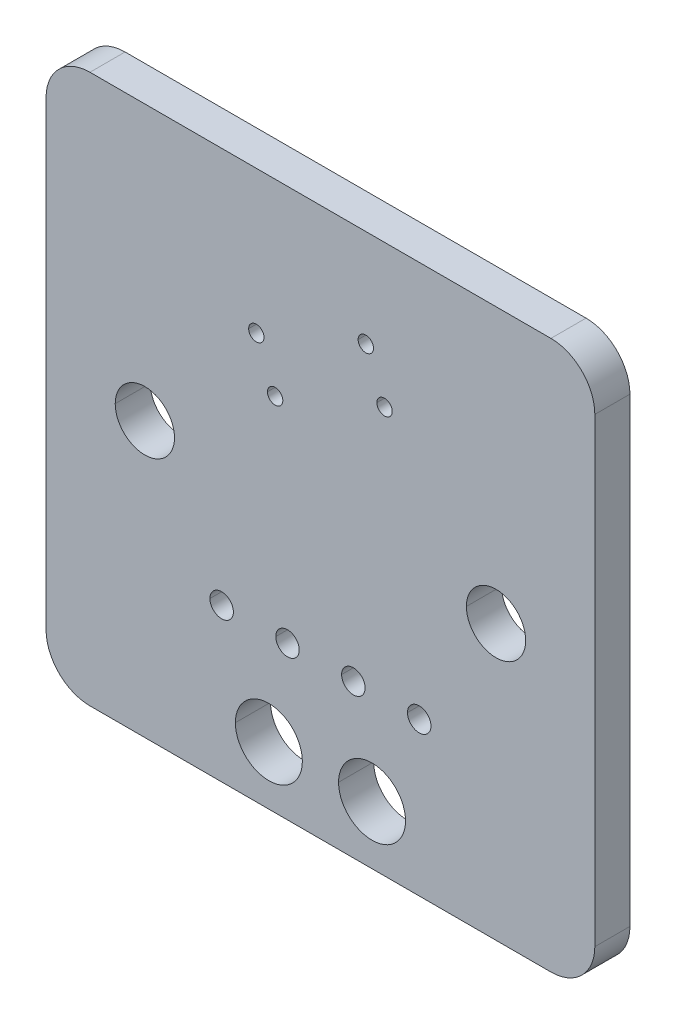
ISO-10303-21;
HEADER;
FILE_DESCRIPTION(('STEP AP214'),'2;1');
FILE_NAME('part.step','',(''),(''),'','','');
FILE_SCHEMA(('AUTOMOTIVE_DESIGN { 1 0 10303 214 1 1 1 1 }'));
ENDSEC;
DATA;
#1=APPLICATION_CONTEXT('core data for automotive mechanical design processes');
#2=APPLICATION_PROTOCOL_DEFINITION('international standard','automotive_design',2000,#1);
#3=PRODUCT_CONTEXT('',#1,'mechanical');
#4=PRODUCT('Part','Part','',(#3));
#5=PRODUCT_RELATED_PRODUCT_CATEGORY('part','',(#4));
#6=PRODUCT_DEFINITION_FORMATION('','',#4);
#7=PRODUCT_DEFINITION_CONTEXT('part definition',#1,'design');
#8=PRODUCT_DEFINITION('design','',#6,#7);
#9=PRODUCT_DEFINITION_SHAPE('','',#8);
#10=(LENGTH_UNIT() NAMED_UNIT(*) SI_UNIT(.MILLI.,.METRE.));
#11=(NAMED_UNIT(*) PLANE_ANGLE_UNIT() SI_UNIT($,.RADIAN.));
#12=(NAMED_UNIT(*) SI_UNIT($,.STERADIAN.) SOLID_ANGLE_UNIT());
#13=UNCERTAINTY_MEASURE_WITH_UNIT(LENGTH_MEASURE(1.E-05),#10,'distance_accuracy_value','');
#14=(GEOMETRIC_REPRESENTATION_CONTEXT(3) GLOBAL_UNCERTAINTY_ASSIGNED_CONTEXT((#13)) GLOBAL_UNIT_ASSIGNED_CONTEXT((#10,
#11,#12)) REPRESENTATION_CONTEXT('',''));
#15=CARTESIAN_POINT('',(0.,0.,0.));
#16=DIRECTION('',(0.,0.,1.));
#17=DIRECTION('',(1.,0.,0.));
#18=AXIS2_PLACEMENT_3D('',#15,#16,#17);
#19=CARTESIAN_POINT('',(43.,-45.,0.));
#20=DIRECTION('',(0.,-1.,0.));
#21=DIRECTION('',(0.,0.,-1.));
#22=AXIS2_PLACEMENT_3D('',#19,#20,#21);
#23=PLANE('',#22);
#24=DIRECTION('',(0.,0.,1.));
#25=VECTOR('',#24,1.);
#26=CARTESIAN_POINT('',(43.,-45.,0.));
#27=LINE('',#26,#25);
#28=CARTESIAN_POINT('',(43.,-45.,0.));
#29=VERTEX_POINT('',#28);
#30=CARTESIAN_POINT('',(43.,-45.,1.6));
#31=VERTEX_POINT('',#30);
#32=EDGE_CURVE('E11',#29,#31,#27,.T.);
#33=ORIENTED_EDGE('',*,*,#32,.T.);
#34=DIRECTION('',(-1.,0.,0.));
#35=VECTOR('',#34,1.);
#36=CARTESIAN_POINT('',(43.,-45.,1.6));
#37=LINE('',#36,#35);
#38=CARTESIAN_POINT('',(22.,-45.,1.6));
#39=VERTEX_POINT('',#38);
#40=EDGE_CURVE('E477',#31,#39,#37,.T.);
#41=ORIENTED_EDGE('',*,*,#40,.T.);
#42=DIRECTION('',(0.,0.,1.));
#43=VECTOR('',#42,1.);
#44=CARTESIAN_POINT('',(22.,-45.,0.));
#45=LINE('',#44,#43);
#46=CARTESIAN_POINT('',(22.,-45.,0.));
#47=VERTEX_POINT('',#46);
#48=EDGE_CURVE('E27',#47,#39,#45,.T.);
#49=ORIENTED_EDGE('',*,*,#48,.F.);
#50=DIRECTION('',(-1.,0.,0.));
#51=VECTOR('',#50,1.);
#52=CARTESIAN_POINT('',(43.,-45.,0.));
#53=LINE('',#52,#51);
#54=EDGE_CURVE('E375',#29,#47,#53,.T.);
#55=ORIENTED_EDGE('',*,*,#54,.F.);
#56=EDGE_LOOP('',(#33,#41,#49,#55));
#57=FACE_BOUND('',#56,.T.);
#58=ADVANCED_FACE('F16',(#57),#23,.T.);
#59=CARTESIAN_POINT('',(43.,-43.,0.));
#60=DIRECTION('',(0.,0.,-1.));
#61=DIRECTION('',(1.,0.,0.));
#62=AXIS2_PLACEMENT_3D('',#59,#60,#61);
#63=CYLINDRICAL_SURFACE('',#62,2.);
#64=CARTESIAN_POINT('',(43.,-43.,0.));
#65=DIRECTION('',(0.,0.,1.));
#66=DIRECTION('',(1.,0.,0.));
#67=AXIS2_PLACEMENT_3D('',#64,#65,#66);
#68=CIRCLE('',#67,2.);
#69=CARTESIAN_POINT('',(45.,-43.,0.));
#70=VERTEX_POINT('',#69);
#71=EDGE_CURVE('E374',#29,#70,#68,.T.);
#72=ORIENTED_EDGE('',*,*,#71,.T.);
#73=DIRECTION('',(0.,0.,1.));
#74=VECTOR('',#73,1.);
#75=CARTESIAN_POINT('',(45.,-43.,0.));
#76=LINE('',#75,#74);
#77=CARTESIAN_POINT('',(45.,-43.,1.6));
#78=VERTEX_POINT('',#77);
#79=EDGE_CURVE('E385',#70,#78,#76,.T.);
#80=ORIENTED_EDGE('',*,*,#79,.T.);
#81=CARTESIAN_POINT('',(43.,-43.,1.6));
#82=DIRECTION('',(0.,0.,1.));
#83=DIRECTION('',(1.,0.,0.));
#84=AXIS2_PLACEMENT_3D('',#81,#82,#83);
#85=CIRCLE('',#84,2.);
#86=EDGE_CURVE('E390',#31,#78,#85,.T.);
#87=ORIENTED_EDGE('',*,*,#86,.F.);
#88=ORIENTED_EDGE('',*,*,#32,.F.);
#89=EDGE_LOOP('',(#72,#80,#87,#88));
#90=FACE_BOUND('',#89,.T.);
#91=ADVANCED_FACE('F709',(#90),#63,.T.);
#92=CARTESIAN_POINT('',(22.,-43.,0.));
#93=DIRECTION('',(0.,0.,-1.));
#94=DIRECTION('',(1.,0.,0.));
#95=AXIS2_PLACEMENT_3D('',#92,#93,#94);
#96=CYLINDRICAL_SURFACE('',#95,2.);
#97=CARTESIAN_POINT('',(22.,-43.,0.));
#98=DIRECTION('',(0.,0.,1.));
#99=DIRECTION('',(1.,0.,0.));
#100=AXIS2_PLACEMENT_3D('',#97,#98,#99);
#101=CIRCLE('',#100,2.);
#102=CARTESIAN_POINT('',(20.,-43.,0.));
#103=VERTEX_POINT('',#102);
#104=EDGE_CURVE('E371',#103,#47,#101,.T.);
#105=ORIENTED_EDGE('',*,*,#104,.T.);
#106=ORIENTED_EDGE('',*,*,#48,.T.);
#107=CARTESIAN_POINT('',(22.,-43.,1.6));
#108=DIRECTION('',(0.,0.,1.));
#109=DIRECTION('',(1.,0.,0.));
#110=AXIS2_PLACEMENT_3D('',#107,#108,#109);
#111=CIRCLE('',#110,2.);
#112=CARTESIAN_POINT('',(20.,-43.,1.6));
#113=VERTEX_POINT('',#112);
#114=EDGE_CURVE('E392',#113,#39,#111,.T.);
#115=ORIENTED_EDGE('',*,*,#114,.F.);
#116=DIRECTION('',(0.,0.,1.));
#117=VECTOR('',#116,1.);
#118=CARTESIAN_POINT('',(20.,-43.,0.));
#119=LINE('',#118,#117);
#120=EDGE_CURVE('E551',#103,#113,#119,.T.);
#121=ORIENTED_EDGE('',*,*,#120,.F.);
#122=EDGE_LOOP('',(#105,#106,#115,#121));
#123=FACE_BOUND('',#122,.T.);
#124=ADVANCED_FACE('F702',(#123),#96,.T.);
#125=CARTESIAN_POINT('',(32.5,-32.5,0.));
#126=DIRECTION('',(0.,0.,-1.));
#127=DIRECTION('',(0.,-1.,0.));
#128=AXIS2_PLACEMENT_3D('',#125,#126,#127);
#129=PLANE('',#128);
#130=CARTESIAN_POINT('',(34.85,-42.35,0.));
#131=DIRECTION('',(0.,0.,1.));
#132=DIRECTION('',(1.,0.,0.));
#133=AXIS2_PLACEMENT_3D('',#130,#131,#132);
#134=CIRCLE('',#133,1.525);
#135=CARTESIAN_POINT('',(36.375,-42.35,0.));
#136=VERTEX_POINT('',#135);
#137=CARTESIAN_POINT('',(33.325,-42.35,0.));
#138=VERTEX_POINT('',#137);
#139=EDGE_CURVE('E363',#136,#138,#134,.T.);
#140=ORIENTED_EDGE('',*,*,#139,.T.);
#141=CARTESIAN_POINT('',(34.85,-42.35,0.));
#142=DIRECTION('',(0.,0.,1.));
#143=DIRECTION('',(1.,0.,0.));
#144=AXIS2_PLACEMENT_3D('',#141,#142,#143);
#145=CIRCLE('',#144,1.525);
#146=EDGE_CURVE('E346',#138,#136,#145,.T.);
#147=ORIENTED_EDGE('',*,*,#146,.T.);
#148=EDGE_LOOP('',(#140,#147));
#149=FACE_BOUND('',#148,.T.);
#150=CARTESIAN_POINT('',(37.,-38.03,0.));
#151=DIRECTION('',(0.,0.,1.));
#152=DIRECTION('',(1.,0.,0.));
#153=AXIS2_PLACEMENT_3D('',#150,#151,#152);
#154=CIRCLE('',#153,0.535);
#155=CARTESIAN_POINT('',(37.535,-38.03,0.));
#156=VERTEX_POINT('',#155);
#157=CARTESIAN_POINT('',(36.465,-38.03,0.));
#158=VERTEX_POINT('',#157);
#159=EDGE_CURVE('E364',#156,#158,#154,.T.);
#160=ORIENTED_EDGE('',*,*,#159,.T.);
#161=CARTESIAN_POINT('',(37.,-38.03,0.));
#162=DIRECTION('',(0.,0.,1.));
#163=DIRECTION('',(1.,0.,0.));
#164=AXIS2_PLACEMENT_3D('',#161,#162,#163);
#165=CIRCLE('',#164,0.535);
#166=EDGE_CURVE('E515',#158,#156,#165,.T.);
#167=ORIENTED_EDGE('',*,*,#166,.T.);
#168=EDGE_LOOP('',(#160,#167));
#169=FACE_BOUND('',#168,.T.);
#170=CARTESIAN_POINT('',(34.,-38.03,0.));
#171=DIRECTION('',(0.,0.,1.));
#172=DIRECTION('',(1.,0.,0.));
#173=AXIS2_PLACEMENT_3D('',#170,#171,#172);
#174=CIRCLE('',#173,0.535);
#175=CARTESIAN_POINT('',(34.535,-38.03,0.));
#176=VERTEX_POINT('',#175);
#177=CARTESIAN_POINT('',(33.465,-38.03,0.));
#178=VERTEX_POINT('',#177);
#179=EDGE_CURVE('E399',#176,#178,#174,.T.);
#180=ORIENTED_EDGE('',*,*,#179,.T.);
#181=CARTESIAN_POINT('',(34.,-38.03,0.));
#182=DIRECTION('',(0.,0.,1.));
#183=DIRECTION('',(1.,0.,0.));
#184=AXIS2_PLACEMENT_3D('',#181,#182,#183);
#185=CIRCLE('',#184,0.535);
#186=EDGE_CURVE('E473',#178,#176,#185,.T.);
#187=ORIENTED_EDGE('',*,*,#186,.T.);
#188=EDGE_LOOP('',(#180,#187));
#189=FACE_BOUND('',#188,.T.);
#190=CARTESIAN_POINT('',(30.15,-42.35,0.));
#191=DIRECTION('',(0.,0.,1.));
#192=DIRECTION('',(1.,0.,0.));
#193=AXIS2_PLACEMENT_3D('',#190,#191,#192);
#194=CIRCLE('',#193,1.525);
#195=CARTESIAN_POINT('',(31.675,-42.35,0.));
#196=VERTEX_POINT('',#195);
#197=CARTESIAN_POINT('',(28.625,-42.35,0.));
#198=VERTEX_POINT('',#197);
#199=EDGE_CURVE('E442',#196,#198,#194,.T.);
#200=ORIENTED_EDGE('',*,*,#199,.T.);
#201=CARTESIAN_POINT('',(30.15,-42.35,0.));
#202=DIRECTION('',(0.,0.,1.));
#203=DIRECTION('',(1.,0.,0.));
#204=AXIS2_PLACEMENT_3D('',#201,#202,#203);
#205=CIRCLE('',#204,1.525);
#206=EDGE_CURVE('E447',#198,#196,#205,.T.);
#207=ORIENTED_EDGE('',*,*,#206,.T.);
#208=EDGE_LOOP('',(#200,#207));
#209=FACE_BOUND('',#208,.T.);
#210=CARTESIAN_POINT('',(31.,-38.03,0.));
#211=DIRECTION('',(0.,0.,1.));
#212=DIRECTION('',(1.,0.,0.));
#213=AXIS2_PLACEMENT_3D('',#210,#211,#212);
#214=CIRCLE('',#213,0.535);
#215=CARTESIAN_POINT('',(31.535,-38.03,0.));
#216=VERTEX_POINT('',#215);
#217=CARTESIAN_POINT('',(30.465,-38.03,0.));
#218=VERTEX_POINT('',#217);
#219=EDGE_CURVE('E395',#216,#218,#214,.T.);
#220=ORIENTED_EDGE('',*,*,#219,.T.);
#221=CARTESIAN_POINT('',(31.,-38.03,0.));
#222=DIRECTION('',(0.,0.,1.));
#223=DIRECTION('',(1.,0.,0.));
#224=AXIS2_PLACEMENT_3D('',#221,#222,#223);
#225=CIRCLE('',#224,0.535);
#226=EDGE_CURVE('E514',#218,#216,#225,.T.);
#227=ORIENTED_EDGE('',*,*,#226,.T.);
#228=EDGE_LOOP('',(#220,#227));
#229=FACE_BOUND('',#228,.T.);
#230=CARTESIAN_POINT('',(28.,-38.03,0.));
#231=DIRECTION('',(0.,0.,1.));
#232=DIRECTION('',(1.,0.,0.));
#233=AXIS2_PLACEMENT_3D('',#230,#231,#232);
#234=CIRCLE('',#233,0.535);
#235=CARTESIAN_POINT('',(28.535,-38.03,0.));
#236=VERTEX_POINT('',#235);
#237=CARTESIAN_POINT('',(27.465,-38.03,0.));
#238=VERTEX_POINT('',#237);
#239=EDGE_CURVE('E235',#236,#238,#234,.T.);
#240=ORIENTED_EDGE('',*,*,#239,.T.);
#241=CARTESIAN_POINT('',(28.,-38.03,0.));
#242=DIRECTION('',(0.,0.,1.));
#243=DIRECTION('',(1.,0.,0.));
#244=AXIS2_PLACEMENT_3D('',#241,#242,#243);
#245=CIRCLE('',#244,0.535);
#246=EDGE_CURVE('E345',#238,#236,#245,.T.);
#247=ORIENTED_EDGE('',*,*,#246,.T.);
#248=EDGE_LOOP('',(#240,#247));
#249=FACE_BOUND('',#248,.T.);
#250=CARTESIAN_POINT('',(40.5,-32.5,0.));
#251=DIRECTION('',(0.,0.,1.));
#252=DIRECTION('',(1.,0.,0.));
#253=AXIS2_PLACEMENT_3D('',#250,#251,#252);
#254=CIRCLE('',#253,1.35);
#255=CARTESIAN_POINT('',(41.85,-32.5,0.));
#256=VERTEX_POINT('',#255);
#257=CARTESIAN_POINT('',(39.15,-32.5,0.));
#258=VERTEX_POINT('',#257);
#259=EDGE_CURVE('E528',#256,#258,#254,.T.);
#260=ORIENTED_EDGE('',*,*,#259,.T.);
#261=CARTESIAN_POINT('',(40.5,-32.5,0.));
#262=DIRECTION('',(0.,0.,1.));
#263=DIRECTION('',(1.,0.,0.));
#264=AXIS2_PLACEMENT_3D('',#261,#262,#263);
#265=CIRCLE('',#264,1.35);
#266=EDGE_CURVE('E558',#258,#256,#265,.T.);
#267=ORIENTED_EDGE('',*,*,#266,.T.);
#268=EDGE_LOOP('',(#260,#267));
#269=FACE_BOUND('',#268,.T.);
#270=CARTESIAN_POINT('',(35.42,-26.5,0.));
#271=DIRECTION('',(0.,0.,1.));
#272=DIRECTION('',(1.,0.,0.));
#273=AXIS2_PLACEMENT_3D('',#270,#271,#272);
#274=CIRCLE('',#273,0.35);
#275=CARTESIAN_POINT('',(35.77,-26.5,0.));
#276=VERTEX_POINT('',#275);
#277=CARTESIAN_POINT('',(35.07,-26.5,0.));
#278=VERTEX_POINT('',#277);
#279=EDGE_CURVE('E403',#276,#278,#274,.T.);
#280=ORIENTED_EDGE('',*,*,#279,.T.);
#281=CARTESIAN_POINT('',(35.42,-26.5,0.));
#282=DIRECTION('',(0.,0.,1.));
#283=DIRECTION('',(1.,0.,0.));
#284=AXIS2_PLACEMENT_3D('',#281,#282,#283);
#285=CIRCLE('',#284,0.35);
#286=EDGE_CURVE('E486',#278,#276,#285,.T.);
#287=ORIENTED_EDGE('',*,*,#286,.T.);
#288=EDGE_LOOP('',(#280,#287));
#289=FACE_BOUND('',#288,.T.);
#290=CARTESIAN_POINT('',(34.56745,-24.43525,0.));
#291=DIRECTION('',(0.,0.,1.));
#292=DIRECTION('',(1.,0.,0.));
#293=AXIS2_PLACEMENT_3D('',#290,#291,#292);
#294=CIRCLE('',#293,0.35);
#295=CARTESIAN_POINT('',(34.91745,-24.43525,0.));
#296=VERTEX_POINT('',#295);
#297=CARTESIAN_POINT('',(34.21745,-24.43525,0.));
#298=VERTEX_POINT('',#297);
#299=EDGE_CURVE('E404',#296,#298,#294,.T.);
#300=ORIENTED_EDGE('',*,*,#299,.T.);
#301=CARTESIAN_POINT('',(34.56745,-24.43525,0.));
#302=DIRECTION('',(0.,0.,1.));
#303=DIRECTION('',(1.,0.,0.));
#304=AXIS2_PLACEMENT_3D('',#301,#302,#303);
#305=CIRCLE('',#304,0.35);
#306=EDGE_CURVE('E410',#298,#296,#305,.T.);
#307=ORIENTED_EDGE('',*,*,#306,.T.);
#308=EDGE_LOOP('',(#300,#307));
#309=FACE_BOUND('',#308,.T.);
#310=CARTESIAN_POINT('',(24.5,-32.5,0.));
#311=DIRECTION('',(0.,0.,1.));
#312=DIRECTION('',(1.,0.,0.));
#313=AXIS2_PLACEMENT_3D('',#310,#311,#312);
#314=CIRCLE('',#313,1.35);
#315=CARTESIAN_POINT('',(25.85,-32.5,0.));
#316=VERTEX_POINT('',#315);
#317=CARTESIAN_POINT('',(23.15,-32.5,0.));
#318=VERTEX_POINT('',#317);
#319=EDGE_CURVE('E468',#316,#318,#314,.T.);
#320=ORIENTED_EDGE('',*,*,#319,.T.);
#321=CARTESIAN_POINT('',(24.5,-32.5,0.));
#322=DIRECTION('',(0.,0.,1.));
#323=DIRECTION('',(1.,0.,0.));
#324=AXIS2_PLACEMENT_3D('',#321,#322,#323);
#325=CIRCLE('',#324,1.35);
#326=EDGE_CURVE('E453',#318,#316,#325,.T.);
#327=ORIENTED_EDGE('',*,*,#326,.T.);
#328=EDGE_LOOP('',(#320,#327));
#329=FACE_BOUND('',#328,.T.);
#330=CARTESIAN_POINT('',(30.43525,-28.56475,0.));
#331=DIRECTION('',(0.,0.,1.));
#332=DIRECTION('',(1.,0.,0.));
#333=AXIS2_PLACEMENT_3D('',#330,#331,#332);
#334=CIRCLE('',#333,0.35);
#335=CARTESIAN_POINT('',(30.78525,-28.56475,0.));
#336=VERTEX_POINT('',#335);
#337=CARTESIAN_POINT('',(30.08525,-28.56475,0.));
#338=VERTEX_POINT('',#337);
#339=EDGE_CURVE('E317',#336,#338,#334,.T.);
#340=ORIENTED_EDGE('',*,*,#339,.T.);
#341=CARTESIAN_POINT('',(30.43525,-28.56475,0.));
#342=DIRECTION('',(0.,0.,1.));
#343=DIRECTION('',(1.,0.,0.));
#344=AXIS2_PLACEMENT_3D('',#341,#342,#343);
#345=CIRCLE('',#344,0.35);
#346=EDGE_CURVE('E499',#338,#336,#345,.T.);
#347=ORIENTED_EDGE('',*,*,#346,.T.);
#348=EDGE_LOOP('',(#340,#347));
#349=FACE_BOUND('',#348,.T.);
#350=CARTESIAN_POINT('',(29.58,-26.5,0.));
#351=DIRECTION('',(0.,0.,1.));
#352=DIRECTION('',(1.,0.,0.));
#353=AXIS2_PLACEMENT_3D('',#350,#351,#352);
#354=CIRCLE('',#353,0.35);
#355=CARTESIAN_POINT('',(29.93,-26.5,0.));
#356=VERTEX_POINT('',#355);
#357=CARTESIAN_POINT('',(29.23,-26.5,0.));
#358=VERTEX_POINT('',#357);
#359=EDGE_CURVE('E302',#356,#358,#354,.T.);
#360=ORIENTED_EDGE('',*,*,#359,.T.);
#361=CARTESIAN_POINT('',(29.58,-26.5,0.));
#362=DIRECTION('',(0.,0.,1.));
#363=DIRECTION('',(1.,0.,0.));
#364=AXIS2_PLACEMENT_3D('',#361,#362,#363);
#365=CIRCLE('',#364,0.35);
#366=EDGE_CURVE('E327',#358,#356,#365,.T.);
#367=ORIENTED_EDGE('',*,*,#366,.T.);
#368=EDGE_LOOP('',(#360,#367));
#369=FACE_BOUND('',#368,.T.);
#370=ORIENTED_EDGE('',*,*,#54,.T.);
#371=ORIENTED_EDGE('',*,*,#104,.F.);
#372=DIRECTION('',(0.,1.,0.));
#373=VECTOR('',#372,1.);
#374=CARTESIAN_POINT('',(20.,-43.,0.));
#375=LINE('',#374,#373);
#376=CARTESIAN_POINT('',(20.,-22.,0.));
#377=VERTEX_POINT('',#376);
#378=EDGE_CURVE('E355',#103,#377,#375,.T.);
#379=ORIENTED_EDGE('',*,*,#378,.T.);
#380=CARTESIAN_POINT('',(22.,-22.,0.));
#381=DIRECTION('',(0.,0.,1.));
#382=DIRECTION('',(1.,0.,0.));
#383=AXIS2_PLACEMENT_3D('',#380,#381,#382);
#384=CIRCLE('',#383,2.);
#385=CARTESIAN_POINT('',(22.,-20.,0.));
#386=VERTEX_POINT('',#385);
#387=EDGE_CURVE('E459',#386,#377,#384,.T.);
#388=ORIENTED_EDGE('',*,*,#387,.F.);
#389=DIRECTION('',(1.,0.,0.));
#390=VECTOR('',#389,1.);
#391=CARTESIAN_POINT('',(22.,-20.,0.));
#392=LINE('',#391,#390);
#393=CARTESIAN_POINT('',(43.,-20.,0.));
#394=VERTEX_POINT('',#393);
#395=EDGE_CURVE('E455',#386,#394,#392,.T.);
#396=ORIENTED_EDGE('',*,*,#395,.T.);
#397=CARTESIAN_POINT('',(43.,-22.,0.));
#398=DIRECTION('',(0.,0.,1.));
#399=DIRECTION('',(1.,0.,0.));
#400=AXIS2_PLACEMENT_3D('',#397,#398,#399);
#401=CIRCLE('',#400,2.);
#402=CARTESIAN_POINT('',(45.,-22.,0.));
#403=VERTEX_POINT('',#402);
#404=EDGE_CURVE('E351',#403,#394,#401,.T.);
#405=ORIENTED_EDGE('',*,*,#404,.F.);
#406=DIRECTION('',(0.,-1.,0.));
#407=VECTOR('',#406,1.);
#408=CARTESIAN_POINT('',(45.,-22.,0.));
#409=LINE('',#408,#407);
#410=EDGE_CURVE('E389',#403,#70,#409,.T.);
#411=ORIENTED_EDGE('',*,*,#410,.T.);
#412=ORIENTED_EDGE('',*,*,#71,.F.);
#413=EDGE_LOOP('',(#370,#371,#379,#388,#396,#405,#411,#412));
#414=FACE_BOUND('',#413,.T.);
#415=ADVANCED_FACE('F683',(#149,#169,#189,#209,#229,#249,#269,#289,#309,#329,#349,#369,#414),
#129,.T.);
#416=CARTESIAN_POINT('',(32.5,-32.5,1.6));
#417=DIRECTION('',(0.,0.,-1.));
#418=DIRECTION('',(0.,-1.,0.));
#419=AXIS2_PLACEMENT_3D('',#416,#417,#418);
#420=PLANE('',#419);
#421=CARTESIAN_POINT('',(34.85,-42.35,1.6));
#422=DIRECTION('',(0.,0.,1.));
#423=DIRECTION('',(1.,0.,0.));
#424=AXIS2_PLACEMENT_3D('',#421,#422,#423);
#425=CIRCLE('',#424,1.525);
#426=CARTESIAN_POINT('',(36.375,-42.35,1.6));
#427=VERTEX_POINT('',#426);
#428=CARTESIAN_POINT('',(33.325,-42.35,1.6));
#429=VERTEX_POINT('',#428);
#430=EDGE_CURVE('E543',#427,#429,#425,.T.);
#431=ORIENTED_EDGE('',*,*,#430,.F.);
#432=CARTESIAN_POINT('',(34.85,-42.35,1.6));
#433=DIRECTION('',(0.,0.,1.));
#434=DIRECTION('',(1.,0.,0.));
#435=AXIS2_PLACEMENT_3D('',#432,#433,#434);
#436=CIRCLE('',#435,1.525);
#437=EDGE_CURVE('E636',#429,#427,#436,.T.);
#438=ORIENTED_EDGE('',*,*,#437,.F.);
#439=EDGE_LOOP('',(#431,#438));
#440=FACE_BOUND('',#439,.T.);
#441=CARTESIAN_POINT('',(37.,-38.03,1.6));
#442=DIRECTION('',(0.,0.,1.));
#443=DIRECTION('',(1.,0.,0.));
#444=AXIS2_PLACEMENT_3D('',#441,#442,#443);
#445=CIRCLE('',#444,0.535);
#446=CARTESIAN_POINT('',(37.535,-38.03,1.6));
#447=VERTEX_POINT('',#446);
#448=CARTESIAN_POINT('',(36.465,-38.03,1.6));
#449=VERTEX_POINT('',#448);
#450=EDGE_CURVE('E360',#447,#449,#445,.T.);
#451=ORIENTED_EDGE('',*,*,#450,.F.);
#452=CARTESIAN_POINT('',(37.,-38.03,1.6));
#453=DIRECTION('',(0.,0.,1.));
#454=DIRECTION('',(1.,0.,0.));
#455=AXIS2_PLACEMENT_3D('',#452,#453,#454);
#456=CIRCLE('',#455,0.535);
#457=EDGE_CURVE('E478',#449,#447,#456,.T.);
#458=ORIENTED_EDGE('',*,*,#457,.F.);
#459=EDGE_LOOP('',(#451,#458));
#460=FACE_BOUND('',#459,.T.);
#461=CARTESIAN_POINT('',(34.,-38.03,1.6));
#462=DIRECTION('',(0.,0.,1.));
#463=DIRECTION('',(1.,0.,0.));
#464=AXIS2_PLACEMENT_3D('',#461,#462,#463);
#465=CIRCLE('',#464,0.535);
#466=CARTESIAN_POINT('',(34.535,-38.03,1.6));
#467=VERTEX_POINT('',#466);
#468=CARTESIAN_POINT('',(33.465,-38.03,1.6));
#469=VERTEX_POINT('',#468);
#470=EDGE_CURVE('E396',#467,#469,#465,.T.);
#471=ORIENTED_EDGE('',*,*,#470,.F.);
#472=CARTESIAN_POINT('',(34.,-38.03,1.6));
#473=DIRECTION('',(0.,0.,1.));
#474=DIRECTION('',(1.,0.,0.));
#475=AXIS2_PLACEMENT_3D('',#472,#473,#474);
#476=CIRCLE('',#475,0.535);
#477=EDGE_CURVE('E448',#469,#467,#476,.T.);
#478=ORIENTED_EDGE('',*,*,#477,.F.);
#479=EDGE_LOOP('',(#471,#478));
#480=FACE_BOUND('',#479,.T.);
#481=CARTESIAN_POINT('',(30.15,-42.35,1.6));
#482=DIRECTION('',(0.,0.,1.));
#483=DIRECTION('',(1.,0.,0.));
#484=AXIS2_PLACEMENT_3D('',#481,#482,#483);
#485=CIRCLE('',#484,1.525);
#486=CARTESIAN_POINT('',(31.675,-42.35,1.6));
#487=VERTEX_POINT('',#486);
#488=CARTESIAN_POINT('',(28.625,-42.35,1.6));
#489=VERTEX_POINT('',#488);
#490=EDGE_CURVE('E413',#487,#489,#485,.T.);
#491=ORIENTED_EDGE('',*,*,#490,.F.);
#492=CARTESIAN_POINT('',(30.15,-42.35,1.6));
#493=DIRECTION('',(0.,0.,1.));
#494=DIRECTION('',(1.,0.,0.));
#495=AXIS2_PLACEMENT_3D('',#492,#493,#494);
#496=CIRCLE('',#495,1.525);
#497=EDGE_CURVE('E365',#489,#487,#496,.T.);
#498=ORIENTED_EDGE('',*,*,#497,.F.);
#499=EDGE_LOOP('',(#491,#498));
#500=FACE_BOUND('',#499,.T.);
#501=CARTESIAN_POINT('',(31.,-38.03,1.6));
#502=DIRECTION('',(0.,0.,1.));
#503=DIRECTION('',(1.,0.,0.));
#504=AXIS2_PLACEMENT_3D('',#501,#502,#503);
#505=CIRCLE('',#504,0.535);
#506=CARTESIAN_POINT('',(31.535,-38.03,1.6));
#507=VERTEX_POINT('',#506);
#508=CARTESIAN_POINT('',(30.465,-38.03,1.6));
#509=VERTEX_POINT('',#508);
#510=EDGE_CURVE('E439',#507,#509,#505,.T.);
#511=ORIENTED_EDGE('',*,*,#510,.F.);
#512=CARTESIAN_POINT('',(31.,-38.03,1.6));
#513=DIRECTION('',(0.,0.,1.));
#514=DIRECTION('',(1.,0.,0.));
#515=AXIS2_PLACEMENT_3D('',#512,#513,#514);
#516=CIRCLE('',#515,0.535);
#517=EDGE_CURVE('E376',#509,#507,#516,.T.);
#518=ORIENTED_EDGE('',*,*,#517,.F.);
#519=EDGE_LOOP('',(#511,#518));
#520=FACE_BOUND('',#519,.T.);
#521=CARTESIAN_POINT('',(28.,-38.03,1.6));
#522=DIRECTION('',(0.,0.,1.));
#523=DIRECTION('',(1.,0.,0.));
#524=AXIS2_PLACEMENT_3D('',#521,#522,#523);
#525=CIRCLE('',#524,0.535);
#526=CARTESIAN_POINT('',(28.535,-38.03,1.6));
#527=VERTEX_POINT('',#526);
#528=CARTESIAN_POINT('',(27.465,-38.03,1.6));
#529=VERTEX_POINT('',#528);
#530=EDGE_CURVE('E226',#527,#529,#525,.T.);
#531=ORIENTED_EDGE('',*,*,#530,.F.);
#532=CARTESIAN_POINT('',(28.,-38.03,1.6));
#533=DIRECTION('',(0.,0.,1.));
#534=DIRECTION('',(1.,0.,0.));
#535=AXIS2_PLACEMENT_3D('',#532,#533,#534);
#536=CIRCLE('',#535,0.535);
#537=EDGE_CURVE('E344',#529,#527,#536,.T.);
#538=ORIENTED_EDGE('',*,*,#537,.F.);
#539=EDGE_LOOP('',(#531,#538));
#540=FACE_BOUND('',#539,.T.);
#541=CARTESIAN_POINT('',(40.5,-32.5,1.6));
#542=DIRECTION('',(0.,0.,1.));
#543=DIRECTION('',(1.,0.,0.));
#544=AXIS2_PLACEMENT_3D('',#541,#542,#543);
#545=CIRCLE('',#544,1.35);
#546=CARTESIAN_POINT('',(41.85,-32.5,1.6));
#547=VERTEX_POINT('',#546);
#548=CARTESIAN_POINT('',(39.15,-32.5,1.6));
#549=VERTEX_POINT('',#548);
#550=EDGE_CURVE('E624',#547,#549,#545,.T.);
#551=ORIENTED_EDGE('',*,*,#550,.F.);
#552=CARTESIAN_POINT('',(40.5,-32.5,1.6));
#553=DIRECTION('',(0.,0.,1.));
#554=DIRECTION('',(1.,0.,0.));
#555=AXIS2_PLACEMENT_3D('',#552,#553,#554);
#556=CIRCLE('',#555,1.35);
#557=EDGE_CURVE('E566',#549,#547,#556,.T.);
#558=ORIENTED_EDGE('',*,*,#557,.F.);
#559=EDGE_LOOP('',(#551,#558));
#560=FACE_BOUND('',#559,.T.);
#561=CARTESIAN_POINT('',(35.42,-26.5,1.6));
#562=DIRECTION('',(0.,0.,1.));
#563=DIRECTION('',(1.,0.,0.));
#564=AXIS2_PLACEMENT_3D('',#561,#562,#563);
#565=CIRCLE('',#564,0.35);
#566=CARTESIAN_POINT('',(35.77,-26.5,1.6));
#567=VERTEX_POINT('',#566);
#568=CARTESIAN_POINT('',(35.07,-26.5,1.6));
#569=VERTEX_POINT('',#568);
#570=EDGE_CURVE('E525',#567,#569,#565,.T.);
#571=ORIENTED_EDGE('',*,*,#570,.F.);
#572=CARTESIAN_POINT('',(35.42,-26.5,1.6));
#573=DIRECTION('',(0.,0.,1.));
#574=DIRECTION('',(1.,0.,0.));
#575=AXIS2_PLACEMENT_3D('',#572,#573,#574);
#576=CIRCLE('',#575,0.35);
#577=EDGE_CURVE('E524',#569,#567,#576,.T.);
#578=ORIENTED_EDGE('',*,*,#577,.F.);
#579=EDGE_LOOP('',(#571,#578));
#580=FACE_BOUND('',#579,.T.);
#581=CARTESIAN_POINT('',(34.56745,-24.43525,1.6));
#582=DIRECTION('',(0.,0.,1.));
#583=DIRECTION('',(1.,0.,0.));
#584=AXIS2_PLACEMENT_3D('',#581,#582,#583);
#585=CIRCLE('',#584,0.35);
#586=CARTESIAN_POINT('',(34.91745,-24.43525,1.6));
#587=VERTEX_POINT('',#586);
#588=CARTESIAN_POINT('',(34.21745,-24.43525,1.6));
#589=VERTEX_POINT('',#588);
#590=EDGE_CURVE('E400',#587,#589,#585,.T.);
#591=ORIENTED_EDGE('',*,*,#590,.F.);
#592=CARTESIAN_POINT('',(34.56745,-24.43525,1.6));
#593=DIRECTION('',(0.,0.,1.));
#594=DIRECTION('',(1.,0.,0.));
#595=AXIS2_PLACEMENT_3D('',#592,#593,#594);
#596=CIRCLE('',#595,0.35);
#597=EDGE_CURVE('E409',#589,#587,#596,.T.);
#598=ORIENTED_EDGE('',*,*,#597,.F.);
#599=EDGE_LOOP('',(#591,#598));
#600=FACE_BOUND('',#599,.T.);
#601=CARTESIAN_POINT('',(24.5,-32.5,1.6));
#602=DIRECTION('',(0.,0.,1.));
#603=DIRECTION('',(1.,0.,0.));
#604=AXIS2_PLACEMENT_3D('',#601,#602,#603);
#605=CIRCLE('',#604,1.35);
#606=CARTESIAN_POINT('',(25.85,-32.5,1.6));
#607=VERTEX_POINT('',#606);
#608=CARTESIAN_POINT('',(23.15,-32.5,1.6));
#609=VERTEX_POINT('',#608);
#610=EDGE_CURVE('E510',#607,#609,#605,.T.);
#611=ORIENTED_EDGE('',*,*,#610,.F.);
#612=CARTESIAN_POINT('',(24.5,-32.5,1.6));
#613=DIRECTION('',(0.,0.,1.));
#614=DIRECTION('',(1.,0.,0.));
#615=AXIS2_PLACEMENT_3D('',#612,#613,#614);
#616=CIRCLE('',#615,1.35);
#617=EDGE_CURVE('E452',#609,#607,#616,.T.);
#618=ORIENTED_EDGE('',*,*,#617,.F.);
#619=EDGE_LOOP('',(#611,#618));
#620=FACE_BOUND('',#619,.T.);
#621=CARTESIAN_POINT('',(30.43525,-28.56475,1.6));
#622=DIRECTION('',(0.,0.,1.));
#623=DIRECTION('',(1.,0.,0.));
#624=AXIS2_PLACEMENT_3D('',#621,#622,#623);
#625=CIRCLE('',#624,0.35);
#626=CARTESIAN_POINT('',(30.78525,-28.56475,1.6));
#627=VERTEX_POINT('',#626);
#628=CARTESIAN_POINT('',(30.08525,-28.56475,1.6));
#629=VERTEX_POINT('',#628);
#630=EDGE_CURVE('E384',#627,#629,#625,.T.);
#631=ORIENTED_EDGE('',*,*,#630,.F.);
#632=CARTESIAN_POINT('',(30.43525,-28.56475,1.6));
#633=DIRECTION('',(0.,0.,1.));
#634=DIRECTION('',(1.,0.,0.));
#635=AXIS2_PLACEMENT_3D('',#632,#633,#634);
#636=CIRCLE('',#635,0.35);
#637=EDGE_CURVE('E498',#629,#627,#636,.T.);
#638=ORIENTED_EDGE('',*,*,#637,.F.);
#639=EDGE_LOOP('',(#631,#638));
#640=FACE_BOUND('',#639,.T.);
#641=CARTESIAN_POINT('',(29.58,-26.5,1.6));
#642=DIRECTION('',(0.,0.,1.));
#643=DIRECTION('',(1.,0.,0.));
#644=AXIS2_PLACEMENT_3D('',#641,#642,#643);
#645=CIRCLE('',#644,0.35);
#646=CARTESIAN_POINT('',(29.93,-26.5,1.6));
#647=VERTEX_POINT('',#646);
#648=CARTESIAN_POINT('',(29.23,-26.5,1.6));
#649=VERTEX_POINT('',#648);
#650=EDGE_CURVE('E307',#647,#649,#645,.T.);
#651=ORIENTED_EDGE('',*,*,#650,.F.);
#652=CARTESIAN_POINT('',(29.58,-26.5,1.6));
#653=DIRECTION('',(0.,0.,1.));
#654=DIRECTION('',(1.,0.,0.));
#655=AXIS2_PLACEMENT_3D('',#652,#653,#654);
#656=CIRCLE('',#655,0.35);
#657=EDGE_CURVE('E319',#649,#647,#656,.T.);
#658=ORIENTED_EDGE('',*,*,#657,.F.);
#659=EDGE_LOOP('',(#651,#658));
#660=FACE_BOUND('',#659,.T.);
#661=ORIENTED_EDGE('',*,*,#86,.T.);
#662=DIRECTION('',(0.,-1.,0.));
#663=VECTOR('',#662,1.);
#664=CARTESIAN_POINT('',(45.,-22.,1.6));
#665=LINE('',#664,#663);
#666=CARTESIAN_POINT('',(45.,-22.,1.6));
#667=VERTEX_POINT('',#666);
#668=EDGE_CURVE('E358',#667,#78,#665,.T.);
#669=ORIENTED_EDGE('',*,*,#668,.F.);
#670=CARTESIAN_POINT('',(43.,-22.,1.6));
#671=DIRECTION('',(0.,0.,1.));
#672=DIRECTION('',(1.,0.,0.));
#673=AXIS2_PLACEMENT_3D('',#670,#671,#672);
#674=CIRCLE('',#673,2.);
#675=CARTESIAN_POINT('',(43.,-20.,1.6));
#676=VERTEX_POINT('',#675);
#677=EDGE_CURVE('E354',#667,#676,#674,.T.);
#678=ORIENTED_EDGE('',*,*,#677,.T.);
#679=DIRECTION('',(1.,0.,0.));
#680=VECTOR('',#679,1.);
#681=CARTESIAN_POINT('',(22.,-20.,1.6));
#682=LINE('',#681,#680);
#683=CARTESIAN_POINT('',(22.,-20.,1.6));
#684=VERTEX_POINT('',#683);
#685=EDGE_CURVE('E414',#684,#676,#682,.T.);
#686=ORIENTED_EDGE('',*,*,#685,.F.);
#687=CARTESIAN_POINT('',(22.,-22.,1.6));
#688=DIRECTION('',(0.,0.,1.));
#689=DIRECTION('',(1.,0.,0.));
#690=AXIS2_PLACEMENT_3D('',#687,#688,#689);
#691=CIRCLE('',#690,2.);
#692=CARTESIAN_POINT('',(20.,-22.,1.6));
#693=VERTEX_POINT('',#692);
#694=EDGE_CURVE('E339',#684,#693,#691,.T.);
#695=ORIENTED_EDGE('',*,*,#694,.T.);
#696=DIRECTION('',(0.,1.,0.));
#697=VECTOR('',#696,1.);
#698=CARTESIAN_POINT('',(20.,-43.,1.6));
#699=LINE('',#698,#697);
#700=EDGE_CURVE('E359',#113,#693,#699,.T.);
#701=ORIENTED_EDGE('',*,*,#700,.F.);
#702=ORIENTED_EDGE('',*,*,#114,.T.);
#703=ORIENTED_EDGE('',*,*,#40,.F.);
#704=EDGE_LOOP('',(#661,#669,#678,#686,#695,#701,#702,#703));
#705=FACE_BOUND('',#704,.T.);
#706=ADVANCED_FACE('F320',(#440,#460,#480,#500,#520,#540,#560,#580,#600,#620,#640,#660,#705),
#420,.F.);
#707=CARTESIAN_POINT('',(45.,-22.,0.));
#708=DIRECTION('',(1.,0.,0.));
#709=DIRECTION('',(0.,1.,0.));
#710=AXIS2_PLACEMENT_3D('',#707,#708,#709);
#711=PLANE('',#710);
#712=DIRECTION('',(0.,0.,1.));
#713=VECTOR('',#712,1.);
#714=CARTESIAN_POINT('',(45.,-22.,0.));
#715=LINE('',#714,#713);
#716=EDGE_CURVE('E623',#403,#667,#715,.T.);
#717=ORIENTED_EDGE('',*,*,#716,.T.);
#718=ORIENTED_EDGE('',*,*,#668,.T.);
#719=ORIENTED_EDGE('',*,*,#79,.F.);
#720=ORIENTED_EDGE('',*,*,#410,.F.);
#721=EDGE_LOOP('',(#717,#718,#719,#720));
#722=FACE_BOUND('',#721,.T.);
#723=ADVANCED_FACE('F682',(#722),#711,.T.);
#724=CARTESIAN_POINT('',(20.,-43.,0.));
#725=DIRECTION('',(-1.,0.,0.));
#726=DIRECTION('',(0.,0.,1.));
#727=AXIS2_PLACEMENT_3D('',#724,#725,#726);
#728=PLANE('',#727);
#729=ORIENTED_EDGE('',*,*,#120,.T.);
#730=ORIENTED_EDGE('',*,*,#700,.T.);
#731=DIRECTION('',(0.,0.,1.));
#732=VECTOR('',#731,1.);
#733=CARTESIAN_POINT('',(20.,-22.,0.));
#734=LINE('',#733,#732);
#735=EDGE_CURVE('E615',#377,#693,#734,.T.);
#736=ORIENTED_EDGE('',*,*,#735,.F.);
#737=ORIENTED_EDGE('',*,*,#378,.F.);
#738=EDGE_LOOP('',(#729,#730,#736,#737));
#739=FACE_BOUND('',#738,.T.);
#740=ADVANCED_FACE('F1259',(#739),#728,.T.);
#741=CARTESIAN_POINT('',(43.,-22.,0.));
#742=DIRECTION('',(0.,0.,-1.));
#743=DIRECTION('',(1.,0.,0.));
#744=AXIS2_PLACEMENT_3D('',#741,#742,#743);
#745=CYLINDRICAL_SURFACE('',#744,2.);
#746=ORIENTED_EDGE('',*,*,#404,.T.);
#747=DIRECTION('',(0.,0.,1.));
#748=VECTOR('',#747,1.);
#749=CARTESIAN_POINT('',(43.,-20.,0.));
#750=LINE('',#749,#748);
#751=EDGE_CURVE('E417',#394,#676,#750,.T.);
#752=ORIENTED_EDGE('',*,*,#751,.T.);
#753=ORIENTED_EDGE('',*,*,#677,.F.);
#754=ORIENTED_EDGE('',*,*,#716,.F.);
#755=EDGE_LOOP('',(#746,#752,#753,#754));
#756=FACE_BOUND('',#755,.T.);
#757=ADVANCED_FACE('F715',(#756),#745,.T.);
#758=CARTESIAN_POINT('',(22.,-22.,0.));
#759=DIRECTION('',(0.,0.,-1.));
#760=DIRECTION('',(1.,0.,0.));
#761=AXIS2_PLACEMENT_3D('',#758,#759,#760);
#762=CYLINDRICAL_SURFACE('',#761,2.);
#763=ORIENTED_EDGE('',*,*,#387,.T.);
#764=ORIENTED_EDGE('',*,*,#735,.T.);
#765=ORIENTED_EDGE('',*,*,#694,.F.);
#766=DIRECTION('',(0.,0.,1.));
#767=VECTOR('',#766,1.);
#768=CARTESIAN_POINT('',(22.,-20.,0.));
#769=LINE('',#768,#767);
#770=EDGE_CURVE('E418',#386,#684,#769,.T.);
#771=ORIENTED_EDGE('',*,*,#770,.F.);
#772=EDGE_LOOP('',(#763,#764,#765,#771));
#773=FACE_BOUND('',#772,.T.);
#774=ADVANCED_FACE('F722',(#773),#762,.T.);
#775=CARTESIAN_POINT('',(22.,-20.,0.));
#776=DIRECTION('',(0.,1.,0.));
#777=DIRECTION('',(1.,0.,0.));
#778=AXIS2_PLACEMENT_3D('',#775,#776,#777);
#779=PLANE('',#778);
#780=ORIENTED_EDGE('',*,*,#770,.T.);
#781=ORIENTED_EDGE('',*,*,#685,.T.);
#782=ORIENTED_EDGE('',*,*,#751,.F.);
#783=ORIENTED_EDGE('',*,*,#395,.F.);
#784=EDGE_LOOP('',(#780,#781,#782,#783));
#785=FACE_BOUND('',#784,.T.);
#786=ADVANCED_FACE('F719',(#785),#779,.T.);
#787=CARTESIAN_POINT('',(34.85,-42.35,-0.8));
#788=DIRECTION('',(0.,0.,1.));
#789=DIRECTION('',(1.,0.,0.));
#790=AXIS2_PLACEMENT_3D('',#787,#788,#789);
#791=CYLINDRICAL_SURFACE('',#790,1.525);
#792=DIRECTION('',(0.,0.,1.));
#793=VECTOR('',#792,1.);
#794=CARTESIAN_POINT('',(33.325,-42.35,-0.8));
#795=LINE('',#794,#793);
#796=EDGE_CURVE('E350',#138,#429,#795,.T.);
#797=ORIENTED_EDGE('',*,*,#796,.F.);
#798=ORIENTED_EDGE('',*,*,#139,.F.);
#799=DIRECTION('',(0.,0.,1.));
#800=VECTOR('',#799,1.);
#801=CARTESIAN_POINT('',(36.375,-42.35,-0.8));
#802=LINE('',#801,#800);
#803=EDGE_CURVE('E519',#136,#427,#802,.T.);
#804=ORIENTED_EDGE('',*,*,#803,.T.);
#805=ORIENTED_EDGE('',*,*,#430,.T.);
#806=EDGE_LOOP('',(#797,#798,#804,#805));
#807=FACE_BOUND('',#806,.T.);
#808=ADVANCED_FACE('F1233',(#807),#791,.F.);
#809=CARTESIAN_POINT('',(37.,-38.03,-0.8));
#810=DIRECTION('',(0.,0.,1.));
#811=DIRECTION('',(1.,0.,0.));
#812=AXIS2_PLACEMENT_3D('',#809,#810,#811);
#813=CYLINDRICAL_SURFACE('',#812,0.535);
#814=DIRECTION('',(0.,0.,1.));
#815=VECTOR('',#814,1.);
#816=CARTESIAN_POINT('',(36.465,-38.03,-0.8));
#817=LINE('',#816,#815);
#818=EDGE_CURVE('E482',#158,#449,#817,.T.);
#819=ORIENTED_EDGE('',*,*,#818,.F.);
#820=ORIENTED_EDGE('',*,*,#159,.F.);
#821=DIRECTION('',(0.,0.,1.));
#822=VECTOR('',#821,1.);
#823=CARTESIAN_POINT('',(37.535,-38.03,-0.8));
#824=LINE('',#823,#822);
#825=EDGE_CURVE('E20',#156,#447,#824,.T.);
#826=ORIENTED_EDGE('',*,*,#825,.T.);
#827=ORIENTED_EDGE('',*,*,#450,.T.);
#828=EDGE_LOOP('',(#819,#820,#826,#827));
#829=FACE_BOUND('',#828,.T.);
#830=ADVANCED_FACE('F1193',(#829),#813,.F.);
#831=CARTESIAN_POINT('',(34.,-38.03,-0.8));
#832=DIRECTION('',(0.,0.,1.));
#833=DIRECTION('',(1.,0.,0.));
#834=AXIS2_PLACEMENT_3D('',#831,#832,#833);
#835=CYLINDRICAL_SURFACE('',#834,0.535);
#836=DIRECTION('',(0.,0.,1.));
#837=VECTOR('',#836,1.);
#838=CARTESIAN_POINT('',(33.465,-38.03,-0.8));
#839=LINE('',#838,#837);
#840=EDGE_CURVE('E469',#178,#469,#839,.T.);
#841=ORIENTED_EDGE('',*,*,#840,.F.);
#842=ORIENTED_EDGE('',*,*,#179,.F.);
#843=DIRECTION('',(0.,0.,1.));
#844=VECTOR('',#843,1.);
#845=CARTESIAN_POINT('',(34.535,-38.03,-0.8));
#846=LINE('',#845,#844);
#847=EDGE_CURVE('E443',#176,#467,#846,.T.);
#848=ORIENTED_EDGE('',*,*,#847,.T.);
#849=ORIENTED_EDGE('',*,*,#470,.T.);
#850=EDGE_LOOP('',(#841,#842,#848,#849));
#851=FACE_BOUND('',#850,.T.);
#852=ADVANCED_FACE('F1264',(#851),#835,.F.);
#853=CARTESIAN_POINT('',(30.15,-42.35,-0.8));
#854=DIRECTION('',(0.,0.,1.));
#855=DIRECTION('',(1.,0.,0.));
#856=AXIS2_PLACEMENT_3D('',#853,#854,#855);
#857=CYLINDRICAL_SURFACE('',#856,1.525);
#858=DIRECTION('',(0.,0.,1.));
#859=VECTOR('',#858,1.);
#860=CARTESIAN_POINT('',(28.625,-42.35,-0.8));
#861=LINE('',#860,#859);
#862=EDGE_CURVE('E370',#198,#489,#861,.T.);
#863=ORIENTED_EDGE('',*,*,#862,.F.);
#864=ORIENTED_EDGE('',*,*,#199,.F.);
#865=DIRECTION('',(0.,0.,1.));
#866=VECTOR('',#865,1.);
#867=CARTESIAN_POINT('',(31.675,-42.35,-0.8));
#868=LINE('',#867,#866);
#869=EDGE_CURVE('E369',#196,#487,#868,.T.);
#870=ORIENTED_EDGE('',*,*,#869,.T.);
#871=ORIENTED_EDGE('',*,*,#490,.T.);
#872=EDGE_LOOP('',(#863,#864,#870,#871));
#873=FACE_BOUND('',#872,.T.);
#874=ADVANCED_FACE('F1219',(#873),#857,.F.);
#875=CARTESIAN_POINT('',(31.,-38.03,-0.8));
#876=DIRECTION('',(0.,0.,1.));
#877=DIRECTION('',(1.,0.,0.));
#878=AXIS2_PLACEMENT_3D('',#875,#876,#877);
#879=CYLINDRICAL_SURFACE('',#878,0.535);
#880=DIRECTION('',(0.,0.,1.));
#881=VECTOR('',#880,1.);
#882=CARTESIAN_POINT('',(30.465,-38.03,-0.8));
#883=LINE('',#882,#881);
#884=EDGE_CURVE('E381',#218,#509,#883,.T.);
#885=ORIENTED_EDGE('',*,*,#884,.F.);
#886=ORIENTED_EDGE('',*,*,#219,.F.);
#887=DIRECTION('',(0.,0.,1.));
#888=VECTOR('',#887,1.);
#889=CARTESIAN_POINT('',(31.535,-38.03,-0.8));
#890=LINE('',#889,#888);
#891=EDGE_CURVE('E380',#216,#507,#890,.T.);
#892=ORIENTED_EDGE('',*,*,#891,.T.);
#893=ORIENTED_EDGE('',*,*,#510,.T.);
#894=EDGE_LOOP('',(#885,#886,#892,#893));
#895=FACE_BOUND('',#894,.T.);
#896=ADVANCED_FACE('F1211',(#895),#879,.F.);
#897=CARTESIAN_POINT('',(28.,-38.03,-0.8));
#898=DIRECTION('',(0.,0.,1.));
#899=DIRECTION('',(1.,0.,0.));
#900=AXIS2_PLACEMENT_3D('',#897,#898,#899);
#901=CYLINDRICAL_SURFACE('',#900,0.535);
#902=DIRECTION('',(0.,0.,1.));
#903=VECTOR('',#902,1.);
#904=CARTESIAN_POINT('',(27.465,-38.03,-0.8));
#905=LINE('',#904,#903);
#906=EDGE_CURVE('E340',#238,#529,#905,.T.);
#907=ORIENTED_EDGE('',*,*,#906,.F.);
#908=ORIENTED_EDGE('',*,*,#239,.F.);
#909=DIRECTION('',(0.,0.,1.));
#910=VECTOR('',#909,1.);
#911=CARTESIAN_POINT('',(28.535,-38.03,-0.8));
#912=LINE('',#911,#910);
#913=EDGE_CURVE('E463',#236,#527,#912,.T.);
#914=ORIENTED_EDGE('',*,*,#913,.T.);
#915=ORIENTED_EDGE('',*,*,#530,.T.);
#916=EDGE_LOOP('',(#907,#908,#914,#915));
#917=FACE_BOUND('',#916,.T.);
#918=ADVANCED_FACE('F1209',(#917),#901,.F.);
#919=CARTESIAN_POINT('',(40.5,-32.5,-0.8));
#920=DIRECTION('',(0.,0.,1.));
#921=DIRECTION('',(1.,0.,0.));
#922=AXIS2_PLACEMENT_3D('',#919,#920,#921);
#923=CYLINDRICAL_SURFACE('',#922,1.35);
#924=DIRECTION('',(0.,0.,1.));
#925=VECTOR('',#924,1.);
#926=CARTESIAN_POINT('',(39.15,-32.5,-0.8));
#927=LINE('',#926,#925);
#928=EDGE_CURVE('E561',#258,#549,#927,.T.);
#929=ORIENTED_EDGE('',*,*,#928,.F.);
#930=ORIENTED_EDGE('',*,*,#259,.F.);
#931=DIRECTION('',(0.,0.,1.));
#932=VECTOR('',#931,1.);
#933=CARTESIAN_POINT('',(41.85,-32.5,-0.8));
#934=LINE('',#933,#932);
#935=EDGE_CURVE('E490',#256,#547,#934,.T.);
#936=ORIENTED_EDGE('',*,*,#935,.T.);
#937=ORIENTED_EDGE('',*,*,#550,.T.);
#938=EDGE_LOOP('',(#929,#930,#936,#937));
#939=FACE_BOUND('',#938,.T.);
#940=ADVANCED_FACE('F675',(#939),#923,.F.);
#941=CARTESIAN_POINT('',(35.42,-26.5,-0.8));
#942=DIRECTION('',(0.,0.,1.));
#943=DIRECTION('',(1.,0.,0.));
#944=AXIS2_PLACEMENT_3D('',#941,#942,#943);
#945=CYLINDRICAL_SURFACE('',#944,0.35);
#946=DIRECTION('',(0.,0.,1.));
#947=VECTOR('',#946,1.);
#948=CARTESIAN_POINT('',(35.07,-26.5,-0.8));
#949=LINE('',#948,#947);
#950=EDGE_CURVE('E489',#278,#569,#949,.T.);
#951=ORIENTED_EDGE('',*,*,#950,.F.);
#952=ORIENTED_EDGE('',*,*,#279,.F.);
#953=DIRECTION('',(0.,0.,1.));
#954=VECTOR('',#953,1.);
#955=CARTESIAN_POINT('',(35.77,-26.5,-0.8));
#956=LINE('',#955,#954);
#957=EDGE_CURVE('E520',#276,#567,#956,.T.);
#958=ORIENTED_EDGE('',*,*,#957,.T.);
#959=ORIENTED_EDGE('',*,*,#570,.T.);
#960=EDGE_LOOP('',(#951,#952,#958,#959));
#961=FACE_BOUND('',#960,.T.);
#962=ADVANCED_FACE('F1217',(#961),#945,.F.);
#963=CARTESIAN_POINT('',(34.56745,-24.43525,-0.8));
#964=DIRECTION('',(0.,0.,1.));
#965=DIRECTION('',(1.,0.,0.));
#966=AXIS2_PLACEMENT_3D('',#963,#964,#965);
#967=CYLINDRICAL_SURFACE('',#966,0.35);
#968=DIRECTION('',(0.,0.,1.));
#969=VECTOR('',#968,1.);
#970=CARTESIAN_POINT('',(34.21745,-24.43525,-0.8));
#971=LINE('',#970,#969);
#972=EDGE_CURVE('E405',#298,#589,#971,.T.);
#973=ORIENTED_EDGE('',*,*,#972,.F.);
#974=ORIENTED_EDGE('',*,*,#299,.F.);
#975=DIRECTION('',(0.,0.,1.));
#976=VECTOR('',#975,1.);
#977=CARTESIAN_POINT('',(34.91745,-24.43525,-0.8));
#978=LINE('',#977,#976);
#979=EDGE_CURVE('E438',#296,#587,#978,.T.);
#980=ORIENTED_EDGE('',*,*,#979,.T.);
#981=ORIENTED_EDGE('',*,*,#590,.T.);
#982=EDGE_LOOP('',(#973,#974,#980,#981));
#983=FACE_BOUND('',#982,.T.);
#984=ADVANCED_FACE('F1238',(#983),#967,.F.);
#985=CARTESIAN_POINT('',(24.5,-32.5,-0.8));
#986=DIRECTION('',(0.,0.,1.));
#987=DIRECTION('',(1.,0.,0.));
#988=AXIS2_PLACEMENT_3D('',#985,#986,#987);
#989=CYLINDRICAL_SURFACE('',#988,1.35);
#990=DIRECTION('',(0.,0.,1.));
#991=VECTOR('',#990,1.);
#992=CARTESIAN_POINT('',(23.15,-32.5,-0.8));
#993=LINE('',#992,#991);
#994=EDGE_CURVE('E449',#318,#609,#993,.T.);
#995=ORIENTED_EDGE('',*,*,#994,.F.);
#996=ORIENTED_EDGE('',*,*,#319,.F.);
#997=DIRECTION('',(0.,0.,1.));
#998=VECTOR('',#997,1.);
#999=CARTESIAN_POINT('',(25.85,-32.5,-0.8));
#1000=LINE('',#999,#998);
#1001=EDGE_CURVE('E587',#316,#607,#1000,.T.);
#1002=ORIENTED_EDGE('',*,*,#1001,.T.);
#1003=ORIENTED_EDGE('',*,*,#610,.T.);
#1004=EDGE_LOOP('',(#995,#996,#1002,#1003));
#1005=FACE_BOUND('',#1004,.T.);
#1006=ADVANCED_FACE('F18',(#1005),#989,.F.);
#1007=CARTESIAN_POINT('',(30.43525,-28.56475,-0.8));
#1008=DIRECTION('',(0.,0.,1.));
#1009=DIRECTION('',(1.,0.,0.));
#1010=AXIS2_PLACEMENT_3D('',#1007,#1008,#1009);
#1011=CYLINDRICAL_SURFACE('',#1010,0.35);
#1012=DIRECTION('',(0.,0.,1.));
#1013=VECTOR('',#1012,1.);
#1014=CARTESIAN_POINT('',(30.08525,-28.56475,-0.8));
#1015=LINE('',#1014,#1013);
#1016=EDGE_CURVE('E494',#338,#629,#1015,.T.);
#1017=ORIENTED_EDGE('',*,*,#1016,.F.);
#1018=ORIENTED_EDGE('',*,*,#339,.F.);
#1019=DIRECTION('',(0.,0.,1.));
#1020=VECTOR('',#1019,1.);
#1021=CARTESIAN_POINT('',(30.78525,-28.56475,-0.8));
#1022=LINE('',#1021,#1020);
#1023=EDGE_CURVE('E335',#336,#627,#1022,.T.);
#1024=ORIENTED_EDGE('',*,*,#1023,.T.);
#1025=ORIENTED_EDGE('',*,*,#630,.T.);
#1026=EDGE_LOOP('',(#1017,#1018,#1024,#1025));
#1027=FACE_BOUND('',#1026,.T.);
#1028=ADVANCED_FACE('F695',(#1027),#1011,.F.);
#1029=CARTESIAN_POINT('',(29.58,-26.5,-0.8));
#1030=DIRECTION('',(0.,0.,1.));
#1031=DIRECTION('',(1.,0.,0.));
#1032=AXIS2_PLACEMENT_3D('',#1029,#1030,#1031);
#1033=CYLINDRICAL_SURFACE('',#1032,0.35);
#1034=DIRECTION('',(0.,0.,1.));
#1035=VECTOR('',#1034,1.);
#1036=CARTESIAN_POINT('',(29.23,-26.5,-0.8));
#1037=LINE('',#1036,#1035);
#1038=EDGE_CURVE('E311',#358,#649,#1037,.T.);
#1039=ORIENTED_EDGE('',*,*,#1038,.F.);
#1040=ORIENTED_EDGE('',*,*,#359,.F.);
#1041=DIRECTION('',(0.,0.,1.));
#1042=VECTOR('',#1041,1.);
#1043=CARTESIAN_POINT('',(29.93,-26.5,-0.8));
#1044=LINE('',#1043,#1042);
#1045=EDGE_CURVE('E313',#356,#647,#1044,.T.);
#1046=ORIENTED_EDGE('',*,*,#1045,.T.);
#1047=ORIENTED_EDGE('',*,*,#650,.T.);
#1048=EDGE_LOOP('',(#1039,#1040,#1046,#1047));
#1049=FACE_BOUND('',#1048,.T.);
#1050=ADVANCED_FACE('F309',(#1049),#1033,.F.);
#1051=CARTESIAN_POINT('',(29.58,-26.5,-0.8));
#1052=DIRECTION('',(0.,0.,1.));
#1053=DIRECTION('',(1.,0.,0.));
#1054=AXIS2_PLACEMENT_3D('',#1051,#1052,#1053);
#1055=CYLINDRICAL_SURFACE('',#1054,0.35);
#1056=ORIENTED_EDGE('',*,*,#366,.F.);
#1057=ORIENTED_EDGE('',*,*,#1038,.T.);
#1058=ORIENTED_EDGE('',*,*,#657,.T.);
#1059=ORIENTED_EDGE('',*,*,#1045,.F.);
#1060=EDGE_LOOP('',(#1056,#1057,#1058,#1059));
#1061=FACE_BOUND('',#1060,.T.);
#1062=ADVANCED_FACE('F325',(#1061),#1055,.F.);
#1063=CARTESIAN_POINT('',(30.43525,-28.56475,-0.8));
#1064=DIRECTION('',(0.,0.,1.));
#1065=DIRECTION('',(1.,0.,0.));
#1066=AXIS2_PLACEMENT_3D('',#1063,#1064,#1065);
#1067=CYLINDRICAL_SURFACE('',#1066,0.35);
#1068=ORIENTED_EDGE('',*,*,#346,.F.);
#1069=ORIENTED_EDGE('',*,*,#1016,.T.);
#1070=ORIENTED_EDGE('',*,*,#637,.T.);
#1071=ORIENTED_EDGE('',*,*,#1023,.F.);
#1072=EDGE_LOOP('',(#1068,#1069,#1070,#1071));
#1073=FACE_BOUND('',#1072,.T.);
#1074=ADVANCED_FACE('F698',(#1073),#1067,.F.);
#1075=CARTESIAN_POINT('',(24.5,-32.5,-0.8));
#1076=DIRECTION('',(0.,0.,1.));
#1077=DIRECTION('',(1.,0.,0.));
#1078=AXIS2_PLACEMENT_3D('',#1075,#1076,#1077);
#1079=CYLINDRICAL_SURFACE('',#1078,1.35);
#1080=ORIENTED_EDGE('',*,*,#326,.F.);
#1081=ORIENTED_EDGE('',*,*,#994,.T.);
#1082=ORIENTED_EDGE('',*,*,#617,.T.);
#1083=ORIENTED_EDGE('',*,*,#1001,.F.);
#1084=EDGE_LOOP('',(#1080,#1081,#1082,#1083));
#1085=FACE_BOUND('',#1084,.T.);
#1086=ADVANCED_FACE('F1255',(#1085),#1079,.F.);
#1087=CARTESIAN_POINT('',(34.56745,-24.43525,-0.8));
#1088=DIRECTION('',(0.,0.,1.));
#1089=DIRECTION('',(1.,0.,0.));
#1090=AXIS2_PLACEMENT_3D('',#1087,#1088,#1089);
#1091=CYLINDRICAL_SURFACE('',#1090,0.35);
#1092=ORIENTED_EDGE('',*,*,#306,.F.);
#1093=ORIENTED_EDGE('',*,*,#972,.T.);
#1094=ORIENTED_EDGE('',*,*,#597,.T.);
#1095=ORIENTED_EDGE('',*,*,#979,.F.);
#1096=EDGE_LOOP('',(#1092,#1093,#1094,#1095));
#1097=FACE_BOUND('',#1096,.T.);
#1098=ADVANCED_FACE('F1251',(#1097),#1091,.F.);
#1099=CARTESIAN_POINT('',(35.42,-26.5,-0.8));
#1100=DIRECTION('',(0.,0.,1.));
#1101=DIRECTION('',(1.,0.,0.));
#1102=AXIS2_PLACEMENT_3D('',#1099,#1100,#1101);
#1103=CYLINDRICAL_SURFACE('',#1102,0.35);
#1104=ORIENTED_EDGE('',*,*,#286,.F.);
#1105=ORIENTED_EDGE('',*,*,#950,.T.);
#1106=ORIENTED_EDGE('',*,*,#577,.T.);
#1107=ORIENTED_EDGE('',*,*,#957,.F.);
#1108=EDGE_LOOP('',(#1104,#1105,#1106,#1107));
#1109=FACE_BOUND('',#1108,.T.);
#1110=ADVANCED_FACE('F1254',(#1109),#1103,.F.);
#1111=CARTESIAN_POINT('',(40.5,-32.5,-0.8));
#1112=DIRECTION('',(0.,0.,1.));
#1113=DIRECTION('',(1.,0.,0.));
#1114=AXIS2_PLACEMENT_3D('',#1111,#1112,#1113);
#1115=CYLINDRICAL_SURFACE('',#1114,1.35);
#1116=ORIENTED_EDGE('',*,*,#266,.F.);
#1117=ORIENTED_EDGE('',*,*,#928,.T.);
#1118=ORIENTED_EDGE('',*,*,#557,.T.);
#1119=ORIENTED_EDGE('',*,*,#935,.F.);
#1120=EDGE_LOOP('',(#1116,#1117,#1118,#1119));
#1121=FACE_BOUND('',#1120,.T.);
#1122=ADVANCED_FACE('F678',(#1121),#1115,.F.);
#1123=CARTESIAN_POINT('',(28.,-38.03,-0.8));
#1124=DIRECTION('',(0.,0.,1.));
#1125=DIRECTION('',(1.,0.,0.));
#1126=AXIS2_PLACEMENT_3D('',#1123,#1124,#1125);
#1127=CYLINDRICAL_SURFACE('',#1126,0.535);
#1128=ORIENTED_EDGE('',*,*,#246,.F.);
#1129=ORIENTED_EDGE('',*,*,#906,.T.);
#1130=ORIENTED_EDGE('',*,*,#537,.T.);
#1131=ORIENTED_EDGE('',*,*,#913,.F.);
#1132=EDGE_LOOP('',(#1128,#1129,#1130,#1131));
#1133=FACE_BOUND('',#1132,.T.);
#1134=ADVANCED_FACE('F1208',(#1133),#1127,.F.);
#1135=CARTESIAN_POINT('',(31.,-38.03,-0.8));
#1136=DIRECTION('',(0.,0.,1.));
#1137=DIRECTION('',(1.,0.,0.));
#1138=AXIS2_PLACEMENT_3D('',#1135,#1136,#1137);
#1139=CYLINDRICAL_SURFACE('',#1138,0.535);
#1140=ORIENTED_EDGE('',*,*,#226,.F.);
#1141=ORIENTED_EDGE('',*,*,#884,.T.);
#1142=ORIENTED_EDGE('',*,*,#517,.T.);
#1143=ORIENTED_EDGE('',*,*,#891,.F.);
#1144=EDGE_LOOP('',(#1140,#1141,#1142,#1143));
#1145=FACE_BOUND('',#1144,.T.);
#1146=ADVANCED_FACE('F1249',(#1145),#1139,.F.);
#1147=CARTESIAN_POINT('',(30.15,-42.35,-0.8));
#1148=DIRECTION('',(0.,0.,1.));
#1149=DIRECTION('',(1.,0.,0.));
#1150=AXIS2_PLACEMENT_3D('',#1147,#1148,#1149);
#1151=CYLINDRICAL_SURFACE('',#1150,1.525);
#1152=ORIENTED_EDGE('',*,*,#206,.F.);
#1153=ORIENTED_EDGE('',*,*,#862,.T.);
#1154=ORIENTED_EDGE('',*,*,#497,.T.);
#1155=ORIENTED_EDGE('',*,*,#869,.F.);
#1156=EDGE_LOOP('',(#1152,#1153,#1154,#1155));
#1157=FACE_BOUND('',#1156,.T.);
#1158=ADVANCED_FACE('F1245',(#1157),#1151,.F.);
#1159=CARTESIAN_POINT('',(34.,-38.03,-0.8));
#1160=DIRECTION('',(0.,0.,1.));
#1161=DIRECTION('',(1.,0.,0.));
#1162=AXIS2_PLACEMENT_3D('',#1159,#1160,#1161);
#1163=CYLINDRICAL_SURFACE('',#1162,0.535);
#1164=ORIENTED_EDGE('',*,*,#186,.F.);
#1165=ORIENTED_EDGE('',*,*,#840,.T.);
#1166=ORIENTED_EDGE('',*,*,#477,.T.);
#1167=ORIENTED_EDGE('',*,*,#847,.F.);
#1168=EDGE_LOOP('',(#1164,#1165,#1166,#1167));
#1169=FACE_BOUND('',#1168,.T.);
#1170=ADVANCED_FACE('F1242',(#1169),#1163,.F.);
#1171=CARTESIAN_POINT('',(37.,-38.03,-0.8));
#1172=DIRECTION('',(0.,0.,1.));
#1173=DIRECTION('',(1.,0.,0.));
#1174=AXIS2_PLACEMENT_3D('',#1171,#1172,#1173);
#1175=CYLINDRICAL_SURFACE('',#1174,0.535);
#1176=ORIENTED_EDGE('',*,*,#166,.F.);
#1177=ORIENTED_EDGE('',*,*,#818,.T.);
#1178=ORIENTED_EDGE('',*,*,#457,.T.);
#1179=ORIENTED_EDGE('',*,*,#825,.F.);
#1180=EDGE_LOOP('',(#1176,#1177,#1178,#1179));
#1181=FACE_BOUND('',#1180,.T.);
#1182=ADVANCED_FACE('F1197',(#1181),#1175,.F.);
#1183=CARTESIAN_POINT('',(34.85,-42.35,-0.8));
#1184=DIRECTION('',(0.,0.,1.));
#1185=DIRECTION('',(1.,0.,0.));
#1186=AXIS2_PLACEMENT_3D('',#1183,#1184,#1185);
#1187=CYLINDRICAL_SURFACE('',#1186,1.525);
#1188=ORIENTED_EDGE('',*,*,#146,.F.);
#1189=ORIENTED_EDGE('',*,*,#796,.T.);
#1190=ORIENTED_EDGE('',*,*,#437,.T.);
#1191=ORIENTED_EDGE('',*,*,#803,.F.);
#1192=EDGE_LOOP('',(#1188,#1189,#1190,#1191));
#1193=FACE_BOUND('',#1192,.T.);
#1194=ADVANCED_FACE('F1234',(#1193),#1187,.F.);
#1195=CLOSED_SHELL('',(#58,#91,#124,#415,#706,#723,#740,#757,#774,#786,#808,#830,#852,#874,#896,
#918,#940,#962,#984,#1006,#1028,#1050,#1062,#1074,#1086,#1098,#1110,#1122,#1134,#1146,#1158,
#1170,#1182,#1194));
#1196=MANIFOLD_SOLID_BREP('B1',#1195);
#1197=ADVANCED_BREP_SHAPE_REPRESENTATION('',(#18,#1196),#14);
#1198=SHAPE_DEFINITION_REPRESENTATION(#9,#1197);
ENDSEC;
END-ISO-10303-21;
